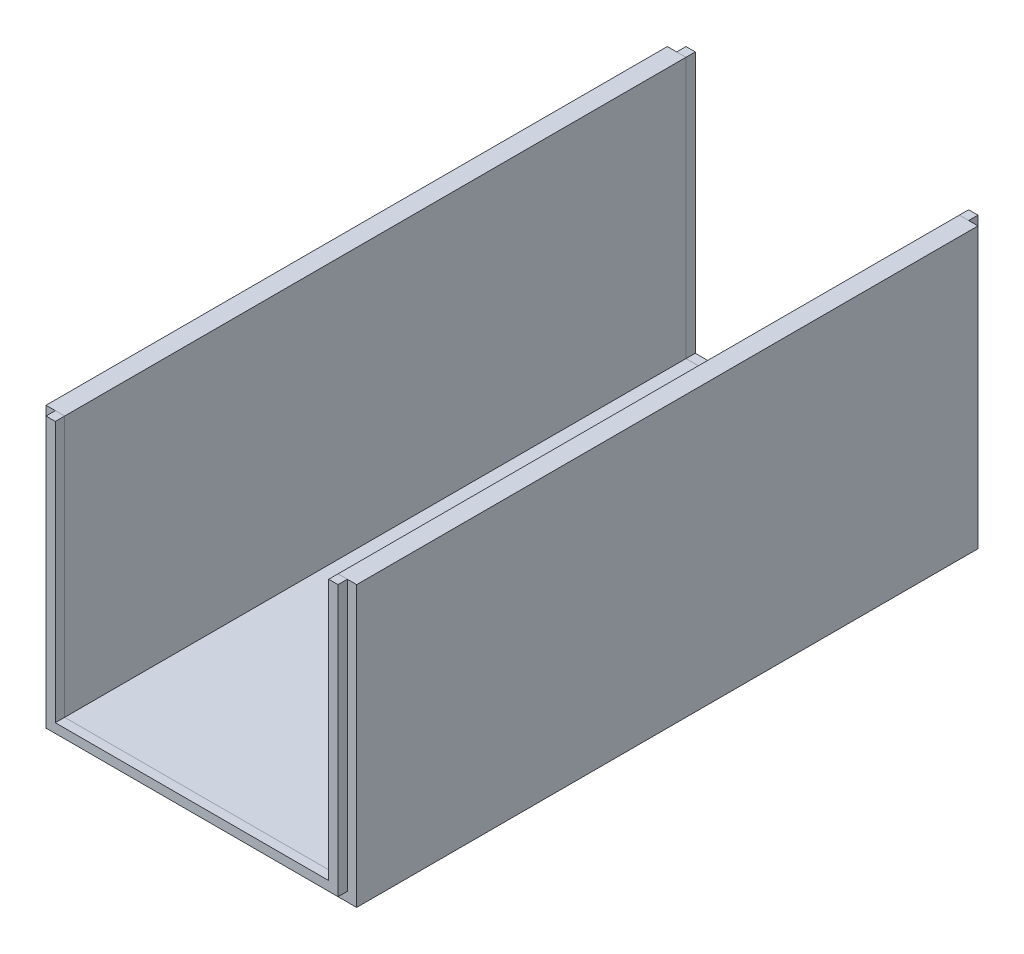
ISO-10303-21;
HEADER;
FILE_DESCRIPTION(('STEP AP214'),'2;1');
FILE_NAME('part.step','',(''),(''),'','','');
FILE_SCHEMA(('AUTOMOTIVE_DESIGN { 1 0 10303 214 1 1 1 1 }'));
ENDSEC;
DATA;
#1=APPLICATION_CONTEXT('core data for automotive mechanical design processes');
#2=APPLICATION_PROTOCOL_DEFINITION('international standard','automotive_design',2000,#1);
#3=PRODUCT_CONTEXT('',#1,'mechanical');
#4=PRODUCT('Part','Part','',(#3));
#5=PRODUCT_RELATED_PRODUCT_CATEGORY('part','',(#4));
#6=PRODUCT_DEFINITION_FORMATION('','',#4);
#7=PRODUCT_DEFINITION_CONTEXT('part definition',#1,'design');
#8=PRODUCT_DEFINITION('design','',#6,#7);
#9=PRODUCT_DEFINITION_SHAPE('','',#8);
#10=(LENGTH_UNIT() NAMED_UNIT(*) SI_UNIT(.MILLI.,.METRE.));
#11=(NAMED_UNIT(*) PLANE_ANGLE_UNIT() SI_UNIT($,.RADIAN.));
#12=(NAMED_UNIT(*) SI_UNIT($,.STERADIAN.) SOLID_ANGLE_UNIT());
#13=UNCERTAINTY_MEASURE_WITH_UNIT(LENGTH_MEASURE(1.E-05),#10,'distance_accuracy_value','');
#14=(GEOMETRIC_REPRESENTATION_CONTEXT(3) GLOBAL_UNCERTAINTY_ASSIGNED_CONTEXT((#13)) GLOBAL_UNIT_ASSIGNED_CONTEXT((#10,
#11,#12)) REPRESENTATION_CONTEXT('',''));
#15=CARTESIAN_POINT('',(0.,0.,0.));
#16=DIRECTION('',(0.,0.,1.));
#17=DIRECTION('',(1.,0.,0.));
#18=AXIS2_PLACEMENT_3D('',#15,#16,#17);
#19=CARTESIAN_POINT('',(-47.,87.,203.));
#20=DIRECTION('',(0.,1.,0.));
#21=DIRECTION('',(0.,0.,-1.));
#22=AXIS2_PLACEMENT_3D('',#19,#20,#21);
#23=PLANE('',#22);
#24=DIRECTION('',(1.,0.,0.));
#25=VECTOR('',#24,1.);
#26=CARTESIAN_POINT('',(-47.,87.,206.));
#27=LINE('',#26,#25);
#28=CARTESIAN_POINT('',(-47.,87.,206.));
#29=VERTEX_POINT('',#28);
#30=CARTESIAN_POINT('',(-44.,87.,206.));
#31=VERTEX_POINT('',#30);
#32=EDGE_CURVE('E143',#29,#31,#27,.T.);
#33=ORIENTED_EDGE('',*,*,#32,.T.);
#34=DIRECTION('',(0.,0.,1.));
#35=VECTOR('',#34,1.);
#36=CARTESIAN_POINT('',(-44.,87.,203.));
#37=LINE('',#36,#35);
#38=CARTESIAN_POINT('',(-44.,87.,203.));
#39=VERTEX_POINT('',#38);
#40=EDGE_CURVE('E50',#39,#31,#37,.T.);
#41=ORIENTED_EDGE('',*,*,#40,.F.);
#42=DIRECTION('',(1.,0.,0.));
#43=VECTOR('',#42,1.);
#44=CARTESIAN_POINT('',(-47.,87.,203.));
#45=LINE('',#44,#43);
#46=CARTESIAN_POINT('',(-47.,87.,203.));
#47=VERTEX_POINT('',#46);
#48=EDGE_CURVE('E156',#47,#39,#45,.T.);
#49=ORIENTED_EDGE('',*,*,#48,.F.);
#50=DIRECTION('',(0.,0.,1.));
#51=VECTOR('',#50,1.);
#52=CARTESIAN_POINT('',(-47.,87.,203.));
#53=LINE('',#52,#51);
#54=EDGE_CURVE('E12',#47,#29,#53,.T.);
#55=ORIENTED_EDGE('',*,*,#54,.T.);
#56=EDGE_LOOP('',(#33,#41,#49,#55));
#57=FACE_BOUND('',#56,.T.);
#58=ADVANCED_FACE('F47',(#57),#23,.T.);
#59=CARTESIAN_POINT('',(-47.,0.,203.));
#60=DIRECTION('',(-1.,0.,0.));
#61=DIRECTION('',(0.,0.,-1.));
#62=AXIS2_PLACEMENT_3D('',#59,#60,#61);
#63=PLANE('',#62);
#64=DIRECTION('',(0.,1.,0.));
#65=VECTOR('',#64,1.);
#66=CARTESIAN_POINT('',(-47.,0.,206.));
#67=LINE('',#66,#65);
#68=CARTESIAN_POINT('',(-47.,0.,206.));
#69=VERTEX_POINT('',#68);
#70=EDGE_CURVE('E100',#69,#29,#67,.T.);
#71=ORIENTED_EDGE('',*,*,#70,.T.);
#72=ORIENTED_EDGE('',*,*,#54,.F.);
#73=DIRECTION('',(0.,1.,0.));
#74=VECTOR('',#73,1.);
#75=CARTESIAN_POINT('',(-47.,0.,203.));
#76=LINE('',#75,#74);
#77=CARTESIAN_POINT('',(-47.,0.,203.));
#78=VERTEX_POINT('',#77);
#79=EDGE_CURVE('E65',#78,#47,#76,.T.);
#80=ORIENTED_EDGE('',*,*,#79,.F.);
#81=DIRECTION('',(0.,0.,1.));
#82=VECTOR('',#81,1.);
#83=CARTESIAN_POINT('',(-47.,0.,203.));
#84=LINE('',#83,#82);
#85=EDGE_CURVE('E56',#78,#69,#84,.T.);
#86=ORIENTED_EDGE('',*,*,#85,.T.);
#87=EDGE_LOOP('',(#71,#72,#80,#86));
#88=FACE_BOUND('',#87,.T.);
#89=ADVANCED_FACE('F202',(#88),#63,.T.);
#90=CARTESIAN_POINT('',(-47.,0.,203.));
#91=DIRECTION('',(0.,1.,0.));
#92=DIRECTION('',(-1.,0.,0.));
#93=AXIS2_PLACEMENT_3D('',#90,#91,#92);
#94=PLANE('',#93);
#95=DIRECTION('',(1.,0.,0.));
#96=VECTOR('',#95,1.);
#97=CARTESIAN_POINT('',(-47.,0.,206.));
#98=LINE('',#97,#96);
#99=CARTESIAN_POINT('',(47.,0.,206.));
#100=VERTEX_POINT('',#99);
#101=EDGE_CURVE('E94',#69,#100,#98,.T.);
#102=ORIENTED_EDGE('',*,*,#101,.F.);
#103=ORIENTED_EDGE('',*,*,#85,.F.);
#104=DIRECTION('',(1.,0.,0.));
#105=VECTOR('',#104,1.);
#106=CARTESIAN_POINT('',(-47.,0.,203.));
#107=LINE('',#106,#105);
#108=CARTESIAN_POINT('',(47.,0.,203.));
#109=VERTEX_POINT('',#108);
#110=EDGE_CURVE('E125',#78,#109,#107,.T.);
#111=ORIENTED_EDGE('',*,*,#110,.T.);
#112=DIRECTION('',(0.,0.,1.));
#113=VECTOR('',#112,1.);
#114=CARTESIAN_POINT('',(47.,0.,203.));
#115=LINE('',#114,#113);
#116=EDGE_CURVE('E132',#109,#100,#115,.T.);
#117=ORIENTED_EDGE('',*,*,#116,.T.);
#118=EDGE_LOOP('',(#102,#103,#111,#117));
#119=FACE_BOUND('',#118,.T.);
#120=ADVANCED_FACE('F138',(#119),#94,.F.);
#121=CARTESIAN_POINT('',(47.,0.,203.));
#122=DIRECTION('',(-1.,0.,0.));
#123=DIRECTION('',(0.,-1.,0.));
#124=AXIS2_PLACEMENT_3D('',#121,#122,#123);
#125=PLANE('',#124);
#126=DIRECTION('',(0.,1.,0.));
#127=VECTOR('',#126,1.);
#128=CARTESIAN_POINT('',(47.,0.,206.));
#129=LINE('',#128,#127);
#130=CARTESIAN_POINT('',(47.,87.,206.));
#131=VERTEX_POINT('',#130);
#132=EDGE_CURVE('E135',#100,#131,#129,.T.);
#133=ORIENTED_EDGE('',*,*,#132,.F.);
#134=ORIENTED_EDGE('',*,*,#116,.F.);
#135=DIRECTION('',(0.,1.,0.));
#136=VECTOR('',#135,1.);
#137=CARTESIAN_POINT('',(47.,0.,203.));
#138=LINE('',#137,#136);
#139=CARTESIAN_POINT('',(47.,87.,203.));
#140=VERTEX_POINT('',#139);
#141=EDGE_CURVE('E121',#109,#140,#138,.T.);
#142=ORIENTED_EDGE('',*,*,#141,.T.);
#143=DIRECTION('',(0.,0.,1.));
#144=VECTOR('',#143,1.);
#145=CARTESIAN_POINT('',(47.,87.,203.));
#146=LINE('',#145,#144);
#147=EDGE_CURVE('E136',#140,#131,#146,.T.);
#148=ORIENTED_EDGE('',*,*,#147,.T.);
#149=EDGE_LOOP('',(#133,#134,#142,#148));
#150=FACE_BOUND('',#149,.T.);
#151=ADVANCED_FACE('F133',(#150),#125,.F.);
#152=CARTESIAN_POINT('',(44.,87.,203.));
#153=DIRECTION('',(0.,1.,0.));
#154=DIRECTION('',(0.,0.,-1.));
#155=AXIS2_PLACEMENT_3D('',#152,#153,#154);
#156=PLANE('',#155);
#157=DIRECTION('',(1.,0.,0.));
#158=VECTOR('',#157,1.);
#159=CARTESIAN_POINT('',(44.,87.,206.));
#160=LINE('',#159,#158);
#161=CARTESIAN_POINT('',(44.,87.,206.));
#162=VERTEX_POINT('',#161);
#163=EDGE_CURVE('E152',#162,#131,#160,.T.);
#164=ORIENTED_EDGE('',*,*,#163,.T.);
#165=ORIENTED_EDGE('',*,*,#147,.F.);
#166=DIRECTION('',(1.,0.,0.));
#167=VECTOR('',#166,1.);
#168=CARTESIAN_POINT('',(44.,87.,203.));
#169=LINE('',#168,#167);
#170=CARTESIAN_POINT('',(44.,87.,203.));
#171=VERTEX_POINT('',#170);
#172=EDGE_CURVE('E127',#171,#140,#169,.T.);
#173=ORIENTED_EDGE('',*,*,#172,.F.);
#174=DIRECTION('',(0.,0.,1.));
#175=VECTOR('',#174,1.);
#176=CARTESIAN_POINT('',(44.,87.,203.));
#177=LINE('',#176,#175);
#178=EDGE_CURVE('E160',#171,#162,#177,.T.);
#179=ORIENTED_EDGE('',*,*,#178,.T.);
#180=EDGE_LOOP('',(#164,#165,#173,#179));
#181=FACE_BOUND('',#180,.T.);
#182=ADVANCED_FACE('F192',(#181),#156,.T.);
#183=CARTESIAN_POINT('',(44.,3.00000000000002,203.));
#184=DIRECTION('',(-1.,0.,0.));
#185=DIRECTION('',(0.,-1.,0.));
#186=AXIS2_PLACEMENT_3D('',#183,#184,#185);
#187=PLANE('',#186);
#188=DIRECTION('',(0.,1.,0.));
#189=VECTOR('',#188,1.);
#190=CARTESIAN_POINT('',(44.,3.00000000000002,206.));
#191=LINE('',#190,#189);
#192=CARTESIAN_POINT('',(44.,3.00000000000002,206.));
#193=VERTEX_POINT('',#192);
#194=EDGE_CURVE('E150',#193,#162,#191,.T.);
#195=ORIENTED_EDGE('',*,*,#194,.T.);
#196=ORIENTED_EDGE('',*,*,#178,.F.);
#197=DIRECTION('',(0.,1.,0.));
#198=VECTOR('',#197,1.);
#199=CARTESIAN_POINT('',(44.,3.00000000000002,203.));
#200=LINE('',#199,#198);
#201=CARTESIAN_POINT('',(44.,3.00000000000002,203.));
#202=VERTEX_POINT('',#201);
#203=EDGE_CURVE('E185',#202,#171,#200,.T.);
#204=ORIENTED_EDGE('',*,*,#203,.F.);
#205=DIRECTION('',(0.,0.,1.));
#206=VECTOR('',#205,1.);
#207=CARTESIAN_POINT('',(44.,3.00000000000002,203.));
#208=LINE('',#207,#206);
#209=EDGE_CURVE('E163',#202,#193,#208,.T.);
#210=ORIENTED_EDGE('',*,*,#209,.T.);
#211=EDGE_LOOP('',(#195,#196,#204,#210));
#212=FACE_BOUND('',#211,.T.);
#213=ADVANCED_FACE('F183',(#212),#187,.T.);
#214=CARTESIAN_POINT('',(-44.,3.,203.));
#215=DIRECTION('',(0.,1.,0.));
#216=DIRECTION('',(-1.,0.,0.));
#217=AXIS2_PLACEMENT_3D('',#214,#215,#216);
#218=PLANE('',#217);
#219=DIRECTION('',(1.,0.,0.));
#220=VECTOR('',#219,1.);
#221=CARTESIAN_POINT('',(-44.,3.,206.));
#222=LINE('',#221,#220);
#223=CARTESIAN_POINT('',(-44.,3.,206.));
#224=VERTEX_POINT('',#223);
#225=EDGE_CURVE('E148',#224,#193,#222,.T.);
#226=ORIENTED_EDGE('',*,*,#225,.T.);
#227=ORIENTED_EDGE('',*,*,#209,.F.);
#228=DIRECTION('',(1.,0.,0.));
#229=VECTOR('',#228,1.);
#230=CARTESIAN_POINT('',(-44.,3.,203.));
#231=LINE('',#230,#229);
#232=CARTESIAN_POINT('',(-44.,3.,203.));
#233=VERTEX_POINT('',#232);
#234=EDGE_CURVE('E186',#233,#202,#231,.T.);
#235=ORIENTED_EDGE('',*,*,#234,.F.);
#236=DIRECTION('',(0.,0.,1.));
#237=VECTOR('',#236,1.);
#238=CARTESIAN_POINT('',(-44.,3.,203.));
#239=LINE('',#238,#237);
#240=EDGE_CURVE('E165',#233,#224,#239,.T.);
#241=ORIENTED_EDGE('',*,*,#240,.T.);
#242=EDGE_LOOP('',(#226,#227,#235,#241));
#243=FACE_BOUND('',#242,.T.);
#244=ADVANCED_FACE('F180',(#243),#218,.T.);
#245=CARTESIAN_POINT('',(-44.,87.,203.));
#246=DIRECTION('',(1.,0.,0.));
#247=DIRECTION('',(0.,0.,1.));
#248=AXIS2_PLACEMENT_3D('',#245,#246,#247);
#249=PLANE('',#248);
#250=DIRECTION('',(0.,-1.,0.));
#251=VECTOR('',#250,1.);
#252=CARTESIAN_POINT('',(-44.,87.,206.));
#253=LINE('',#252,#251);
#254=EDGE_CURVE('E146',#31,#224,#253,.T.);
#255=ORIENTED_EDGE('',*,*,#254,.T.);
#256=ORIENTED_EDGE('',*,*,#240,.F.);
#257=DIRECTION('',(0.,-1.,0.));
#258=VECTOR('',#257,1.);
#259=CARTESIAN_POINT('',(-44.,87.,203.));
#260=LINE('',#259,#258);
#261=EDGE_CURVE('E108',#39,#233,#260,.T.);
#262=ORIENTED_EDGE('',*,*,#261,.F.);
#263=ORIENTED_EDGE('',*,*,#40,.T.);
#264=EDGE_LOOP('',(#255,#256,#262,#263));
#265=FACE_BOUND('',#264,.T.);
#266=ADVANCED_FACE('F171',(#265),#249,.T.);
#267=CARTESIAN_POINT('',(0.,0.,203.));
#268=DIRECTION('',(0.,0.,1.));
#269=DIRECTION('',(-1.,0.,0.));
#270=AXIS2_PLACEMENT_3D('',#267,#268,#269);
#271=PLANE('',#270);
#272=ORIENTED_EDGE('',*,*,#48,.T.);
#273=ORIENTED_EDGE('',*,*,#261,.T.);
#274=ORIENTED_EDGE('',*,*,#234,.T.);
#275=ORIENTED_EDGE('',*,*,#203,.T.);
#276=ORIENTED_EDGE('',*,*,#172,.T.);
#277=ORIENTED_EDGE('',*,*,#141,.F.);
#278=ORIENTED_EDGE('',*,*,#110,.F.);
#279=ORIENTED_EDGE('',*,*,#79,.T.);
#280=EDGE_LOOP('',(#272,#273,#274,#275,#276,#277,#278,#279));
#281=FACE_BOUND('',#280,.T.);
#282=ADVANCED_FACE('F123',(#281),#271,.F.);
#283=CARTESIAN_POINT('',(0.,0.,206.));
#284=DIRECTION('',(0.,0.,1.));
#285=DIRECTION('',(-1.,0.,0.));
#286=AXIS2_PLACEMENT_3D('',#283,#284,#285);
#287=PLANE('',#286);
#288=ORIENTED_EDGE('',*,*,#32,.F.);
#289=ORIENTED_EDGE('',*,*,#70,.F.);
#290=ORIENTED_EDGE('',*,*,#101,.T.);
#291=ORIENTED_EDGE('',*,*,#132,.T.);
#292=ORIENTED_EDGE('',*,*,#163,.F.);
#293=ORIENTED_EDGE('',*,*,#194,.F.);
#294=ORIENTED_EDGE('',*,*,#225,.F.);
#295=ORIENTED_EDGE('',*,*,#254,.F.);
#296=EDGE_LOOP('',(#288,#289,#290,#291,#292,#293,#294,#295));
#297=FACE_BOUND('',#296,.T.);
#298=ADVANCED_FACE('F176',(#297),#287,.T.);
#299=CLOSED_SHELL('',(#58,#89,#120,#151,#182,#213,#244,#266,#282,#298));
#300=MANIFOLD_SOLID_BREP('B2',#299);
#301=CARTESIAN_POINT('',(-50.,87.,103.));
#302=DIRECTION('',(0.,-1.,0.));
#303=DIRECTION('',(1.,0.,0.));
#304=AXIS2_PLACEMENT_3D('',#301,#302,#303);
#305=PLANE('',#304);
#306=DIRECTION('',(-1.,0.,0.));
#307=VECTOR('',#306,1.);
#308=CARTESIAN_POINT('',(-50.,87.,3.));
#309=LINE('',#308,#307);
#310=CARTESIAN_POINT('',(-44.,87.,3.));
#311=VERTEX_POINT('',#310);
#312=CARTESIAN_POINT('',(-50.,87.,3.));
#313=VERTEX_POINT('',#312);
#314=EDGE_CURVE('E431',#311,#313,#309,.T.);
#315=ORIENTED_EDGE('',*,*,#314,.T.);
#316=DIRECTION('',(0.,0.,-1.));
#317=VECTOR('',#316,1.);
#318=CARTESIAN_POINT('',(-50.,87.,103.));
#319=LINE('',#318,#317);
#320=CARTESIAN_POINT('',(-50.,87.,203.));
#321=VERTEX_POINT('',#320);
#322=EDGE_CURVE('E45',#321,#313,#319,.T.);
#323=ORIENTED_EDGE('',*,*,#322,.F.);
#324=DIRECTION('',(-1.,0.,0.));
#325=VECTOR('',#324,1.);
#326=CARTESIAN_POINT('',(-50.,87.,203.));
#327=LINE('',#326,#325);
#328=CARTESIAN_POINT('',(-44.,87.,203.));
#329=VERTEX_POINT('',#328);
#330=EDGE_CURVE('E404',#329,#321,#327,.T.);
#331=ORIENTED_EDGE('',*,*,#330,.F.);
#332=DIRECTION('',(0.,0.,-1.));
#333=VECTOR('',#332,1.);
#334=CARTESIAN_POINT('',(-44.,87.,103.));
#335=LINE('',#334,#333);
#336=EDGE_CURVE('E448',#329,#311,#335,.T.);
#337=ORIENTED_EDGE('',*,*,#336,.T.);
#338=EDGE_LOOP('',(#315,#323,#331,#337));
#339=FACE_BOUND('',#338,.T.);
#340=ADVANCED_FACE('F283',(#339),#305,.F.);
#341=CARTESIAN_POINT('',(-50.,-2.99999999999999,103.));
#342=DIRECTION('',(1.,0.,0.));
#343=DIRECTION('',(0.,0.,-1.));
#344=AXIS2_PLACEMENT_3D('',#341,#342,#343);
#345=PLANE('',#344);
#346=DIRECTION('',(0.,-1.,0.));
#347=VECTOR('',#346,1.);
#348=CARTESIAN_POINT('',(-50.,-2.99999999999999,3.));
#349=LINE('',#348,#347);
#350=CARTESIAN_POINT('',(-50.,-2.99999999999999,3.));
#351=VERTEX_POINT('',#350);
#352=EDGE_CURVE('E434',#313,#351,#349,.T.);
#353=ORIENTED_EDGE('',*,*,#352,.T.);
#354=DIRECTION('',(0.,0.,-1.));
#355=VECTOR('',#354,1.);
#356=CARTESIAN_POINT('',(-50.,-2.99999999999999,103.));
#357=LINE('',#356,#355);
#358=CARTESIAN_POINT('',(-50.,-2.99999999999999,203.));
#359=VERTEX_POINT('',#358);
#360=EDGE_CURVE('E290',#359,#351,#357,.T.);
#361=ORIENTED_EDGE('',*,*,#360,.F.);
#362=DIRECTION('',(0.,-1.,0.));
#363=VECTOR('',#362,1.);
#364=CARTESIAN_POINT('',(-50.,-2.99999999999999,203.));
#365=LINE('',#364,#363);
#366=EDGE_CURVE('E410',#321,#359,#365,.T.);
#367=ORIENTED_EDGE('',*,*,#366,.F.);
#368=ORIENTED_EDGE('',*,*,#322,.T.);
#369=EDGE_LOOP('',(#353,#361,#367,#368));
#370=FACE_BOUND('',#369,.T.);
#371=ADVANCED_FACE('F486',(#370),#345,.F.);
#372=CARTESIAN_POINT('',(50.,-2.99999999999998,103.));
#373=DIRECTION('',(0.,1.,0.));
#374=DIRECTION('',(-1.,0.,0.));
#375=AXIS2_PLACEMENT_3D('',#372,#373,#374);
#376=PLANE('',#375);
#377=DIRECTION('',(1.,0.,0.));
#378=VECTOR('',#377,1.);
#379=CARTESIAN_POINT('',(-6.25,-2.99999999999999,114.5));
#380=LINE('',#379,#378);
#381=CARTESIAN_POINT('',(-6.25,-2.99999999999999,114.5));
#382=VERTEX_POINT('',#381);
#383=CARTESIAN_POINT('',(6.25,-2.99999999999999,114.5));
#384=VERTEX_POINT('',#383);
#385=EDGE_CURVE('E379',#382,#384,#380,.T.);
#386=ORIENTED_EDGE('',*,*,#385,.T.);
#387=DIRECTION('',(0.,0.,-1.));
#388=VECTOR('',#387,1.);
#389=CARTESIAN_POINT('',(6.25,-2.99999999999999,114.5));
#390=LINE('',#389,#388);
#391=CARTESIAN_POINT('',(6.25,-2.99999999999999,91.5));
#392=VERTEX_POINT('',#391);
#393=EDGE_CURVE('E373',#384,#392,#390,.T.);
#394=ORIENTED_EDGE('',*,*,#393,.T.);
#395=DIRECTION('',(-1.,0.,0.));
#396=VECTOR('',#395,1.);
#397=CARTESIAN_POINT('',(-6.25,-2.99999999999999,91.5));
#398=LINE('',#397,#396);
#399=CARTESIAN_POINT('',(-6.25,-2.99999999999998,91.5));
#400=VERTEX_POINT('',#399);
#401=EDGE_CURVE('E382',#392,#400,#398,.T.);
#402=ORIENTED_EDGE('',*,*,#401,.T.);
#403=DIRECTION('',(0.,0.,1.));
#404=VECTOR('',#403,1.);
#405=CARTESIAN_POINT('',(-6.25,-2.99999999999999,114.5));
#406=LINE('',#405,#404);
#407=EDGE_CURVE('E297',#400,#382,#406,.T.);
#408=ORIENTED_EDGE('',*,*,#407,.T.);
#409=EDGE_LOOP('',(#386,#394,#402,#408));
#410=FACE_BOUND('',#409,.T.);
#411=DIRECTION('',(1.,0.,0.));
#412=VECTOR('',#411,1.);
#413=CARTESIAN_POINT('',(50.,-2.99999999999998,3.));
#414=LINE('',#413,#412);
#415=CARTESIAN_POINT('',(50.,-2.99999999999998,3.));
#416=VERTEX_POINT('',#415);
#417=EDGE_CURVE('E436',#351,#416,#414,.T.);
#418=ORIENTED_EDGE('',*,*,#417,.T.);
#419=DIRECTION('',(0.,0.,-1.));
#420=VECTOR('',#419,1.);
#421=CARTESIAN_POINT('',(50.,-2.99999999999998,103.));
#422=LINE('',#421,#420);
#423=CARTESIAN_POINT('',(50.,-2.99999999999998,203.));
#424=VERTEX_POINT('',#423);
#425=EDGE_CURVE('E463',#424,#416,#422,.T.);
#426=ORIENTED_EDGE('',*,*,#425,.F.);
#427=DIRECTION('',(1.,0.,0.));
#428=VECTOR('',#427,1.);
#429=CARTESIAN_POINT('',(50.,-2.99999999999998,203.));
#430=LINE('',#429,#428);
#431=EDGE_CURVE('E413',#359,#424,#430,.T.);
#432=ORIENTED_EDGE('',*,*,#431,.F.);
#433=ORIENTED_EDGE('',*,*,#360,.T.);
#434=EDGE_LOOP('',(#418,#426,#432,#433));
#435=FACE_BOUND('',#434,.T.);
#436=ADVANCED_FACE('F386',(#410,#435),#376,.F.);
#437=CARTESIAN_POINT('',(50.,87.,103.));
#438=DIRECTION('',(-1.,0.,0.));
#439=DIRECTION('',(0.,-1.,0.));
#440=AXIS2_PLACEMENT_3D('',#437,#438,#439);
#441=PLANE('',#440);
#442=DIRECTION('',(0.,1.,0.));
#443=VECTOR('',#442,1.);
#444=CARTESIAN_POINT('',(50.,87.,3.));
#445=LINE('',#444,#443);
#446=CARTESIAN_POINT('',(50.,87.,3.));
#447=VERTEX_POINT('',#446);
#448=EDGE_CURVE('E438',#416,#447,#445,.T.);
#449=ORIENTED_EDGE('',*,*,#448,.T.);
#450=DIRECTION('',(0.,0.,-1.));
#451=VECTOR('',#450,1.);
#452=CARTESIAN_POINT('',(50.,87.,103.));
#453=LINE('',#452,#451);
#454=CARTESIAN_POINT('',(50.,87.,203.));
#455=VERTEX_POINT('',#454);
#456=EDGE_CURVE('E460',#455,#447,#453,.T.);
#457=ORIENTED_EDGE('',*,*,#456,.F.);
#458=DIRECTION('',(0.,1.,0.));
#459=VECTOR('',#458,1.);
#460=CARTESIAN_POINT('',(50.,87.,203.));
#461=LINE('',#460,#459);
#462=EDGE_CURVE('E416',#424,#455,#461,.T.);
#463=ORIENTED_EDGE('',*,*,#462,.F.);
#464=ORIENTED_EDGE('',*,*,#425,.T.);
#465=EDGE_LOOP('',(#449,#457,#463,#464));
#466=FACE_BOUND('',#465,.T.);
#467=ADVANCED_FACE('F477',(#466),#441,.F.);
#468=CARTESIAN_POINT('',(44.,87.,103.));
#469=DIRECTION('',(0.,-1.,0.));
#470=DIRECTION('',(1.,0.,0.));
#471=AXIS2_PLACEMENT_3D('',#468,#469,#470);
#472=PLANE('',#471);
#473=DIRECTION('',(-1.,0.,0.));
#474=VECTOR('',#473,1.);
#475=CARTESIAN_POINT('',(44.,87.,3.));
#476=LINE('',#475,#474);
#477=CARTESIAN_POINT('',(44.,87.,3.));
#478=VERTEX_POINT('',#477);
#479=EDGE_CURVE('E440',#447,#478,#476,.T.);
#480=ORIENTED_EDGE('',*,*,#479,.T.);
#481=DIRECTION('',(0.,0.,-1.));
#482=VECTOR('',#481,1.);
#483=CARTESIAN_POINT('',(44.,87.,103.));
#484=LINE('',#483,#482);
#485=CARTESIAN_POINT('',(44.,87.,203.));
#486=VERTEX_POINT('',#485);
#487=EDGE_CURVE('E457',#486,#478,#484,.T.);
#488=ORIENTED_EDGE('',*,*,#487,.F.);
#489=DIRECTION('',(-1.,0.,0.));
#490=VECTOR('',#489,1.);
#491=CARTESIAN_POINT('',(44.,87.,203.));
#492=LINE('',#491,#490);
#493=EDGE_CURVE('E419',#455,#486,#492,.T.);
#494=ORIENTED_EDGE('',*,*,#493,.F.);
#495=ORIENTED_EDGE('',*,*,#456,.T.);
#496=EDGE_LOOP('',(#480,#488,#494,#495));
#497=FACE_BOUND('',#496,.T.);
#498=ADVANCED_FACE('F481',(#497),#472,.F.);
#499=CARTESIAN_POINT('',(44.,3.00000000000002,103.));
#500=DIRECTION('',(1.,0.,0.));
#501=DIRECTION('',(0.,1.,0.));
#502=AXIS2_PLACEMENT_3D('',#499,#500,#501);
#503=PLANE('',#502);
#504=DIRECTION('',(0.,-1.,0.));
#505=VECTOR('',#504,1.);
#506=CARTESIAN_POINT('',(44.,3.00000000000002,3.));
#507=LINE('',#506,#505);
#508=CARTESIAN_POINT('',(44.,3.00000000000002,3.));
#509=VERTEX_POINT('',#508);
#510=EDGE_CURVE('E442',#478,#509,#507,.T.);
#511=ORIENTED_EDGE('',*,*,#510,.T.);
#512=DIRECTION('',(0.,0.,-1.));
#513=VECTOR('',#512,1.);
#514=CARTESIAN_POINT('',(44.,3.00000000000002,103.));
#515=LINE('',#514,#513);
#516=CARTESIAN_POINT('',(44.,3.00000000000002,203.));
#517=VERTEX_POINT('',#516);
#518=EDGE_CURVE('E454',#517,#509,#515,.T.);
#519=ORIENTED_EDGE('',*,*,#518,.F.);
#520=DIRECTION('',(0.,-1.,0.));
#521=VECTOR('',#520,1.);
#522=CARTESIAN_POINT('',(44.,3.00000000000002,203.));
#523=LINE('',#522,#521);
#524=EDGE_CURVE('E422',#486,#517,#523,.T.);
#525=ORIENTED_EDGE('',*,*,#524,.F.);
#526=ORIENTED_EDGE('',*,*,#487,.T.);
#527=EDGE_LOOP('',(#511,#519,#525,#526));
#528=FACE_BOUND('',#527,.T.);
#529=ADVANCED_FACE('F497',(#528),#503,.F.);
#530=CARTESIAN_POINT('',(-44.,3.,103.));
#531=DIRECTION('',(0.,-1.,0.));
#532=DIRECTION('',(1.,0.,0.));
#533=AXIS2_PLACEMENT_3D('',#530,#531,#532);
#534=PLANE('',#533);
#535=DIRECTION('',(-1.,0.,0.));
#536=VECTOR('',#535,1.);
#537=CARTESIAN_POINT('',(-6.25,3.00000000000001,91.5));
#538=LINE('',#537,#536);
#539=CARTESIAN_POINT('',(6.25000000000001,3.00000000000001,91.5));
#540=VERTEX_POINT('',#539);
#541=CARTESIAN_POINT('',(-6.25,3.00000000000001,91.5));
#542=VERTEX_POINT('',#541);
#543=EDGE_CURVE('E398',#540,#542,#538,.T.);
#544=ORIENTED_EDGE('',*,*,#543,.F.);
#545=DIRECTION('',(0.,0.,-1.));
#546=VECTOR('',#545,1.);
#547=CARTESIAN_POINT('',(6.25,3.00000000000001,114.5));
#548=LINE('',#547,#546);
#549=CARTESIAN_POINT('',(6.25,3.00000000000001,114.5));
#550=VERTEX_POINT('',#549);
#551=EDGE_CURVE('E305',#550,#540,#548,.T.);
#552=ORIENTED_EDGE('',*,*,#551,.F.);
#553=DIRECTION('',(1.,0.,0.));
#554=VECTOR('',#553,1.);
#555=CARTESIAN_POINT('',(-6.25,3.00000000000001,114.5));
#556=LINE('',#555,#554);
#557=CARTESIAN_POINT('',(-6.25,3.00000000000001,114.5));
#558=VERTEX_POINT('',#557);
#559=EDGE_CURVE('E389',#558,#550,#556,.T.);
#560=ORIENTED_EDGE('',*,*,#559,.F.);
#561=DIRECTION('',(0.,0.,1.));
#562=VECTOR('',#561,1.);
#563=CARTESIAN_POINT('',(-6.25,3.00000000000001,114.5));
#564=LINE('',#563,#562);
#565=EDGE_CURVE('E392',#542,#558,#564,.T.);
#566=ORIENTED_EDGE('',*,*,#565,.F.);
#567=EDGE_LOOP('',(#544,#552,#560,#566));
#568=FACE_BOUND('',#567,.T.);
#569=DIRECTION('',(-1.,0.,0.));
#570=VECTOR('',#569,1.);
#571=CARTESIAN_POINT('',(-44.,3.,3.));
#572=LINE('',#571,#570);
#573=CARTESIAN_POINT('',(-44.,3.,3.));
#574=VERTEX_POINT('',#573);
#575=EDGE_CURVE('E444',#509,#574,#572,.T.);
#576=ORIENTED_EDGE('',*,*,#575,.T.);
#577=DIRECTION('',(0.,0.,-1.));
#578=VECTOR('',#577,1.);
#579=CARTESIAN_POINT('',(-44.,3.,103.));
#580=LINE('',#579,#578);
#581=CARTESIAN_POINT('',(-44.,3.,203.));
#582=VERTEX_POINT('',#581);
#583=EDGE_CURVE('E451',#582,#574,#580,.T.);
#584=ORIENTED_EDGE('',*,*,#583,.F.);
#585=DIRECTION('',(-1.,0.,0.));
#586=VECTOR('',#585,1.);
#587=CARTESIAN_POINT('',(-44.,3.,203.));
#588=LINE('',#587,#586);
#589=EDGE_CURVE('E425',#517,#582,#588,.T.);
#590=ORIENTED_EDGE('',*,*,#589,.F.);
#591=ORIENTED_EDGE('',*,*,#518,.T.);
#592=EDGE_LOOP('',(#576,#584,#590,#591));
#593=FACE_BOUND('',#592,.T.);
#594=ADVANCED_FACE('F495',(#568,#593),#534,.F.);
#595=CARTESIAN_POINT('',(-44.,87.,103.));
#596=DIRECTION('',(-1.,0.,0.));
#597=DIRECTION('',(0.,0.,1.));
#598=AXIS2_PLACEMENT_3D('',#595,#596,#597);
#599=PLANE('',#598);
#600=DIRECTION('',(0.,1.,0.));
#601=VECTOR('',#600,1.);
#602=CARTESIAN_POINT('',(-44.,87.,3.));
#603=LINE('',#602,#601);
#604=EDGE_CURVE('E446',#574,#311,#603,.T.);
#605=ORIENTED_EDGE('',*,*,#604,.T.);
#606=ORIENTED_EDGE('',*,*,#336,.F.);
#607=DIRECTION('',(0.,1.,0.));
#608=VECTOR('',#607,1.);
#609=CARTESIAN_POINT('',(-44.,87.,203.));
#610=LINE('',#609,#608);
#611=EDGE_CURVE('E428',#582,#329,#610,.T.);
#612=ORIENTED_EDGE('',*,*,#611,.F.);
#613=ORIENTED_EDGE('',*,*,#583,.T.);
#614=EDGE_LOOP('',(#605,#606,#612,#613));
#615=FACE_BOUND('',#614,.T.);
#616=ADVANCED_FACE('F491',(#615),#599,.F.);
#617=CARTESIAN_POINT('',(0.,0.,3.));
#618=DIRECTION('',(0.,0.,-1.));
#619=DIRECTION('',(-1.,0.,0.));
#620=AXIS2_PLACEMENT_3D('',#617,#618,#619);
#621=PLANE('',#620);
#622=ORIENTED_EDGE('',*,*,#314,.F.);
#623=ORIENTED_EDGE('',*,*,#604,.F.);
#624=ORIENTED_EDGE('',*,*,#575,.F.);
#625=ORIENTED_EDGE('',*,*,#510,.F.);
#626=ORIENTED_EDGE('',*,*,#479,.F.);
#627=ORIENTED_EDGE('',*,*,#448,.F.);
#628=ORIENTED_EDGE('',*,*,#417,.F.);
#629=ORIENTED_EDGE('',*,*,#352,.F.);
#630=EDGE_LOOP('',(#622,#623,#624,#625,#626,#627,#628,#629));
#631=FACE_BOUND('',#630,.T.);
#632=ADVANCED_FACE('F473',(#631),#621,.T.);
#633=CARTESIAN_POINT('',(0.,0.,203.));
#634=DIRECTION('',(0.,0.,1.));
#635=DIRECTION('',(-1.,0.,0.));
#636=AXIS2_PLACEMENT_3D('',#633,#634,#635);
#637=PLANE('',#636);
#638=ORIENTED_EDGE('',*,*,#330,.T.);
#639=ORIENTED_EDGE('',*,*,#366,.T.);
#640=ORIENTED_EDGE('',*,*,#431,.T.);
#641=ORIENTED_EDGE('',*,*,#462,.T.);
#642=ORIENTED_EDGE('',*,*,#493,.T.);
#643=ORIENTED_EDGE('',*,*,#524,.T.);
#644=ORIENTED_EDGE('',*,*,#589,.T.);
#645=ORIENTED_EDGE('',*,*,#611,.T.);
#646=EDGE_LOOP('',(#638,#639,#640,#641,#642,#643,#644,#645));
#647=FACE_BOUND('',#646,.T.);
#648=ADVANCED_FACE('F484',(#647),#637,.T.);
#649=CARTESIAN_POINT('',(6.25,-2.99999999999999,114.5));
#650=DIRECTION('',(1.,0.,0.));
#651=DIRECTION('',(0.,1.,0.));
#652=AXIS2_PLACEMENT_3D('',#649,#650,#651);
#653=PLANE('',#652);
#654=ORIENTED_EDGE('',*,*,#551,.T.);
#655=DIRECTION('',(0.,1.,0.));
#656=VECTOR('',#655,1.);
#657=CARTESIAN_POINT('',(6.25,-2.99999999999999,91.5));
#658=LINE('',#657,#656);
#659=EDGE_CURVE('E369',#392,#540,#658,.T.);
#660=ORIENTED_EDGE('',*,*,#659,.F.);
#661=ORIENTED_EDGE('',*,*,#393,.F.);
#662=DIRECTION('',(0.,1.,0.));
#663=VECTOR('',#662,1.);
#664=CARTESIAN_POINT('',(6.25,-2.99999999999999,114.5));
#665=LINE('',#664,#663);
#666=EDGE_CURVE('E402',#384,#550,#665,.T.);
#667=ORIENTED_EDGE('',*,*,#666,.T.);
#668=EDGE_LOOP('',(#654,#660,#661,#667));
#669=FACE_BOUND('',#668,.T.);
#670=ADVANCED_FACE('F371',(#669),#653,.F.);
#671=CARTESIAN_POINT('',(-6.25,-2.99999999999999,114.5));
#672=DIRECTION('',(0.,0.,1.));
#673=DIRECTION('',(1.,0.,0.));
#674=AXIS2_PLACEMENT_3D('',#671,#672,#673);
#675=PLANE('',#674);
#676=ORIENTED_EDGE('',*,*,#559,.T.);
#677=ORIENTED_EDGE('',*,*,#666,.F.);
#678=ORIENTED_EDGE('',*,*,#385,.F.);
#679=DIRECTION('',(0.,1.,0.));
#680=VECTOR('',#679,1.);
#681=CARTESIAN_POINT('',(-6.25,-2.99999999999999,114.5));
#682=LINE('',#681,#680);
#683=EDGE_CURVE('E405',#382,#558,#682,.T.);
#684=ORIENTED_EDGE('',*,*,#683,.T.);
#685=EDGE_LOOP('',(#676,#677,#678,#684));
#686=FACE_BOUND('',#685,.T.);
#687=ADVANCED_FACE('F571',(#686),#675,.F.);
#688=CARTESIAN_POINT('',(-6.25,-2.99999999999999,114.5));
#689=DIRECTION('',(-1.,0.,0.));
#690=DIRECTION('',(0.,-1.,0.));
#691=AXIS2_PLACEMENT_3D('',#688,#689,#690);
#692=PLANE('',#691);
#693=ORIENTED_EDGE('',*,*,#565,.T.);
#694=ORIENTED_EDGE('',*,*,#683,.F.);
#695=ORIENTED_EDGE('',*,*,#407,.F.);
#696=DIRECTION('',(0.,1.,0.));
#697=VECTOR('',#696,1.);
#698=CARTESIAN_POINT('',(-6.25,-2.99999999999999,91.5));
#699=LINE('',#698,#697);
#700=EDGE_CURVE('E378',#400,#542,#699,.T.);
#701=ORIENTED_EDGE('',*,*,#700,.T.);
#702=EDGE_LOOP('',(#693,#694,#695,#701));
#703=FACE_BOUND('',#702,.T.);
#704=ADVANCED_FACE('F580',(#703),#692,.F.);
#705=CARTESIAN_POINT('',(-6.25,-2.99999999999999,91.5));
#706=DIRECTION('',(0.,0.,-1.));
#707=DIRECTION('',(-1.,0.,0.));
#708=AXIS2_PLACEMENT_3D('',#705,#706,#707);
#709=PLANE('',#708);
#710=ORIENTED_EDGE('',*,*,#543,.T.);
#711=ORIENTED_EDGE('',*,*,#700,.F.);
#712=ORIENTED_EDGE('',*,*,#401,.F.);
#713=ORIENTED_EDGE('',*,*,#659,.T.);
#714=EDGE_LOOP('',(#710,#711,#712,#713));
#715=FACE_BOUND('',#714,.T.);
#716=ADVANCED_FACE('F383',(#715),#709,.F.);
#717=CLOSED_SHELL('',(#340,#371,#436,#467,#498,#529,#594,#616,#632,#648,#670,#687,#704,#716));
#718=MANIFOLD_SOLID_BREP('B6',#717);
#719=CARTESIAN_POINT('',(-47.,87.,3.));
#720=DIRECTION('',(0.,1.,0.));
#721=DIRECTION('',(0.,0.,1.));
#722=AXIS2_PLACEMENT_3D('',#719,#720,#721);
#723=PLANE('',#722);
#724=DIRECTION('',(1.,0.,0.));
#725=VECTOR('',#724,1.);
#726=CARTESIAN_POINT('',(-47.,87.,0.));
#727=LINE('',#726,#725);
#728=CARTESIAN_POINT('',(-47.,87.,0.));
#729=VERTEX_POINT('',#728);
#730=CARTESIAN_POINT('',(-44.,87.,0.));
#731=VERTEX_POINT('',#730);
#732=EDGE_CURVE('E737',#729,#731,#727,.T.);
#733=ORIENTED_EDGE('',*,*,#732,.F.);
#734=DIRECTION('',(0.,0.,-1.));
#735=VECTOR('',#734,1.);
#736=CARTESIAN_POINT('',(-47.,87.,3.));
#737=LINE('',#736,#735);
#738=CARTESIAN_POINT('',(-47.,87.,3.));
#739=VERTEX_POINT('',#738);
#740=EDGE_CURVE('E281',#739,#729,#737,.T.);
#741=ORIENTED_EDGE('',*,*,#740,.F.);
#742=DIRECTION('',(1.,0.,0.));
#743=VECTOR('',#742,1.);
#744=CARTESIAN_POINT('',(-47.,87.,3.));
#745=LINE('',#744,#743);
#746=CARTESIAN_POINT('',(-44.,87.,3.));
#747=VERTEX_POINT('',#746);
#748=EDGE_CURVE('E757',#739,#747,#745,.T.);
#749=ORIENTED_EDGE('',*,*,#748,.T.);
#750=DIRECTION('',(0.,0.,-1.));
#751=VECTOR('',#750,1.);
#752=CARTESIAN_POINT('',(-44.,87.,3.));
#753=LINE('',#752,#751);
#754=EDGE_CURVE('E643',#747,#731,#753,.T.);
#755=ORIENTED_EDGE('',*,*,#754,.T.);
#756=EDGE_LOOP('',(#733,#741,#749,#755));
#757=FACE_BOUND('',#756,.T.);
#758=ADVANCED_FACE('F640',(#757),#723,.T.);
#759=CARTESIAN_POINT('',(-47.,0.,3.));
#760=DIRECTION('',(-1.,0.,0.));
#761=DIRECTION('',(0.,0.,1.));
#762=AXIS2_PLACEMENT_3D('',#759,#760,#761);
#763=PLANE('',#762);
#764=DIRECTION('',(0.,1.,0.));
#765=VECTOR('',#764,1.);
#766=CARTESIAN_POINT('',(-47.,0.,0.));
#767=LINE('',#766,#765);
#768=CARTESIAN_POINT('',(-47.,0.,0.));
#769=VERTEX_POINT('',#768);
#770=EDGE_CURVE('E755',#769,#729,#767,.T.);
#771=ORIENTED_EDGE('',*,*,#770,.F.);
#772=DIRECTION('',(0.,0.,-1.));
#773=VECTOR('',#772,1.);
#774=CARTESIAN_POINT('',(-47.,0.,3.));
#775=LINE('',#774,#773);
#776=CARTESIAN_POINT('',(-47.,0.,3.));
#777=VERTEX_POINT('',#776);
#778=EDGE_CURVE('E649',#777,#769,#775,.T.);
#779=ORIENTED_EDGE('',*,*,#778,.F.);
#780=DIRECTION('',(0.,1.,0.));
#781=VECTOR('',#780,1.);
#782=CARTESIAN_POINT('',(-47.,0.,3.));
#783=LINE('',#782,#781);
#784=EDGE_CURVE('E717',#777,#739,#783,.T.);
#785=ORIENTED_EDGE('',*,*,#784,.T.);
#786=ORIENTED_EDGE('',*,*,#740,.T.);
#787=EDGE_LOOP('',(#771,#779,#785,#786));
#788=FACE_BOUND('',#787,.T.);
#789=ADVANCED_FACE('F769',(#788),#763,.T.);
#790=CARTESIAN_POINT('',(-47.,0.,3.));
#791=DIRECTION('',(0.,1.,0.));
#792=DIRECTION('',(-1.,0.,0.));
#793=AXIS2_PLACEMENT_3D('',#790,#791,#792);
#794=PLANE('',#793);
#795=DIRECTION('',(1.,0.,0.));
#796=VECTOR('',#795,1.);
#797=CARTESIAN_POINT('',(-47.,0.,0.));
#798=LINE('',#797,#796);
#799=CARTESIAN_POINT('',(47.,0.,0.));
#800=VERTEX_POINT('',#799);
#801=EDGE_CURVE('E722',#769,#800,#798,.T.);
#802=ORIENTED_EDGE('',*,*,#801,.T.);
#803=DIRECTION('',(0.,0.,-1.));
#804=VECTOR('',#803,1.);
#805=CARTESIAN_POINT('',(47.,0.,3.));
#806=LINE('',#805,#804);
#807=CARTESIAN_POINT('',(47.,0.,3.));
#808=VERTEX_POINT('',#807);
#809=EDGE_CURVE('E720',#808,#800,#806,.T.);
#810=ORIENTED_EDGE('',*,*,#809,.F.);
#811=DIRECTION('',(1.,0.,0.));
#812=VECTOR('',#811,1.);
#813=CARTESIAN_POINT('',(-47.,0.,3.));
#814=LINE('',#813,#812);
#815=EDGE_CURVE('E710',#777,#808,#814,.T.);
#816=ORIENTED_EDGE('',*,*,#815,.F.);
#817=ORIENTED_EDGE('',*,*,#778,.T.);
#818=EDGE_LOOP('',(#802,#810,#816,#817));
#819=FACE_BOUND('',#818,.T.);
#820=ADVANCED_FACE('F721',(#819),#794,.F.);
#821=CARTESIAN_POINT('',(47.,0.,3.));
#822=DIRECTION('',(-1.,0.,0.));
#823=DIRECTION('',(0.,-1.,0.));
#824=AXIS2_PLACEMENT_3D('',#821,#822,#823);
#825=PLANE('',#824);
#826=DIRECTION('',(0.,1.,0.));
#827=VECTOR('',#826,1.);
#828=CARTESIAN_POINT('',(47.,0.,0.));
#829=LINE('',#828,#827);
#830=CARTESIAN_POINT('',(47.,87.,0.));
#831=VERTEX_POINT('',#830);
#832=EDGE_CURVE('E752',#800,#831,#829,.T.);
#833=ORIENTED_EDGE('',*,*,#832,.T.);
#834=DIRECTION('',(0.,0.,-1.));
#835=VECTOR('',#834,1.);
#836=CARTESIAN_POINT('',(47.,87.,3.));
#837=LINE('',#836,#835);
#838=CARTESIAN_POINT('',(47.,87.,3.));
#839=VERTEX_POINT('',#838);
#840=EDGE_CURVE('E726',#839,#831,#837,.T.);
#841=ORIENTED_EDGE('',*,*,#840,.F.);
#842=DIRECTION('',(0.,1.,0.));
#843=VECTOR('',#842,1.);
#844=CARTESIAN_POINT('',(47.,0.,3.));
#845=LINE('',#844,#843);
#846=EDGE_CURVE('E715',#808,#839,#845,.T.);
#847=ORIENTED_EDGE('',*,*,#846,.F.);
#848=ORIENTED_EDGE('',*,*,#809,.T.);
#849=EDGE_LOOP('',(#833,#841,#847,#848));
#850=FACE_BOUND('',#849,.T.);
#851=ADVANCED_FACE('F728',(#850),#825,.F.);
#852=CARTESIAN_POINT('',(44.,87.,3.));
#853=DIRECTION('',(0.,1.,0.));
#854=DIRECTION('',(0.,0.,1.));
#855=AXIS2_PLACEMENT_3D('',#852,#853,#854);
#856=PLANE('',#855);
#857=DIRECTION('',(1.,0.,0.));
#858=VECTOR('',#857,1.);
#859=CARTESIAN_POINT('',(44.,87.,0.));
#860=LINE('',#859,#858);
#861=CARTESIAN_POINT('',(44.,87.,0.));
#862=VERTEX_POINT('',#861);
#863=EDGE_CURVE('E749',#862,#831,#860,.T.);
#864=ORIENTED_EDGE('',*,*,#863,.F.);
#865=DIRECTION('',(0.,0.,-1.));
#866=VECTOR('',#865,1.);
#867=CARTESIAN_POINT('',(44.,87.,3.));
#868=LINE('',#867,#866);
#869=CARTESIAN_POINT('',(44.,87.,3.));
#870=VERTEX_POINT('',#869);
#871=EDGE_CURVE('E761',#870,#862,#868,.T.);
#872=ORIENTED_EDGE('',*,*,#871,.F.);
#873=DIRECTION('',(1.,0.,0.));
#874=VECTOR('',#873,1.);
#875=CARTESIAN_POINT('',(44.,87.,3.));
#876=LINE('',#875,#874);
#877=EDGE_CURVE('E730',#870,#839,#876,.T.);
#878=ORIENTED_EDGE('',*,*,#877,.T.);
#879=ORIENTED_EDGE('',*,*,#840,.T.);
#880=EDGE_LOOP('',(#864,#872,#878,#879));
#881=FACE_BOUND('',#880,.T.);
#882=ADVANCED_FACE('F782',(#881),#856,.T.);
#883=CARTESIAN_POINT('',(44.,3.00000000000002,3.));
#884=DIRECTION('',(-1.,0.,0.));
#885=DIRECTION('',(0.,-1.,0.));
#886=AXIS2_PLACEMENT_3D('',#883,#884,#885);
#887=PLANE('',#886);
#888=DIRECTION('',(0.,1.,0.));
#889=VECTOR('',#888,1.);
#890=CARTESIAN_POINT('',(44.,3.00000000000002,0.));
#891=LINE('',#890,#889);
#892=CARTESIAN_POINT('',(44.,3.00000000000002,0.));
#893=VERTEX_POINT('',#892);
#894=EDGE_CURVE('E746',#893,#862,#891,.T.);
#895=ORIENTED_EDGE('',*,*,#894,.F.);
#896=DIRECTION('',(0.,0.,-1.));
#897=VECTOR('',#896,1.);
#898=CARTESIAN_POINT('',(44.,3.00000000000002,3.));
#899=LINE('',#898,#897);
#900=CARTESIAN_POINT('',(44.,3.00000000000002,3.));
#901=VERTEX_POINT('',#900);
#902=EDGE_CURVE('E763',#901,#893,#899,.T.);
#903=ORIENTED_EDGE('',*,*,#902,.F.);
#904=DIRECTION('',(0.,1.,0.));
#905=VECTOR('',#904,1.);
#906=CARTESIAN_POINT('',(44.,3.00000000000002,3.));
#907=LINE('',#906,#905);
#908=EDGE_CURVE('E732',#901,#870,#907,.T.);
#909=ORIENTED_EDGE('',*,*,#908,.T.);
#910=ORIENTED_EDGE('',*,*,#871,.T.);
#911=EDGE_LOOP('',(#895,#903,#909,#910));
#912=FACE_BOUND('',#911,.T.);
#913=ADVANCED_FACE('F785',(#912),#887,.T.);
#914=CARTESIAN_POINT('',(-44.,3.,3.));
#915=DIRECTION('',(0.,1.,0.));
#916=DIRECTION('',(-1.,0.,0.));
#917=AXIS2_PLACEMENT_3D('',#914,#915,#916);
#918=PLANE('',#917);
#919=DIRECTION('',(1.,0.,0.));
#920=VECTOR('',#919,1.);
#921=CARTESIAN_POINT('',(-44.,3.,0.));
#922=LINE('',#921,#920);
#923=CARTESIAN_POINT('',(-44.,3.,0.));
#924=VERTEX_POINT('',#923);
#925=EDGE_CURVE('E743',#924,#893,#922,.T.);
#926=ORIENTED_EDGE('',*,*,#925,.F.);
#927=DIRECTION('',(0.,0.,-1.));
#928=VECTOR('',#927,1.);
#929=CARTESIAN_POINT('',(-44.,3.,3.));
#930=LINE('',#929,#928);
#931=CARTESIAN_POINT('',(-44.,3.,3.));
#932=VERTEX_POINT('',#931);
#933=EDGE_CURVE('E764',#932,#924,#930,.T.);
#934=ORIENTED_EDGE('',*,*,#933,.F.);
#935=DIRECTION('',(1.,0.,0.));
#936=VECTOR('',#935,1.);
#937=CARTESIAN_POINT('',(-44.,3.,3.));
#938=LINE('',#937,#936);
#939=EDGE_CURVE('E860',#932,#901,#938,.T.);
#940=ORIENTED_EDGE('',*,*,#939,.T.);
#941=ORIENTED_EDGE('',*,*,#902,.T.);
#942=EDGE_LOOP('',(#926,#934,#940,#941));
#943=FACE_BOUND('',#942,.T.);
#944=ADVANCED_FACE('F789',(#943),#918,.T.);
#945=CARTESIAN_POINT('',(-44.,87.,3.));
#946=DIRECTION('',(1.,0.,0.));
#947=DIRECTION('',(0.,0.,-1.));
#948=AXIS2_PLACEMENT_3D('',#945,#946,#947);
#949=PLANE('',#948);
#950=DIRECTION('',(0.,-1.,0.));
#951=VECTOR('',#950,1.);
#952=CARTESIAN_POINT('',(-44.,87.,0.));
#953=LINE('',#952,#951);
#954=EDGE_CURVE('E740',#731,#924,#953,.T.);
#955=ORIENTED_EDGE('',*,*,#954,.F.);
#956=ORIENTED_EDGE('',*,*,#754,.F.);
#957=DIRECTION('',(0.,-1.,0.));
#958=VECTOR('',#957,1.);
#959=CARTESIAN_POINT('',(-44.,87.,3.));
#960=LINE('',#959,#958);
#961=EDGE_CURVE('E861',#747,#932,#960,.T.);
#962=ORIENTED_EDGE('',*,*,#961,.T.);
#963=ORIENTED_EDGE('',*,*,#933,.T.);
#964=EDGE_LOOP('',(#955,#956,#962,#963));
#965=FACE_BOUND('',#964,.T.);
#966=ADVANCED_FACE('F766',(#965),#949,.T.);
#967=CARTESIAN_POINT('',(0.,0.,3.));
#968=DIRECTION('',(0.,0.,-1.));
#969=DIRECTION('',(-1.,0.,0.));
#970=AXIS2_PLACEMENT_3D('',#967,#968,#969);
#971=PLANE('',#970);
#972=ORIENTED_EDGE('',*,*,#748,.F.);
#973=ORIENTED_EDGE('',*,*,#784,.F.);
#974=ORIENTED_EDGE('',*,*,#815,.T.);
#975=ORIENTED_EDGE('',*,*,#846,.T.);
#976=ORIENTED_EDGE('',*,*,#877,.F.);
#977=ORIENTED_EDGE('',*,*,#908,.F.);
#978=ORIENTED_EDGE('',*,*,#939,.F.);
#979=ORIENTED_EDGE('',*,*,#961,.F.);
#980=EDGE_LOOP('',(#972,#973,#974,#975,#976,#977,#978,#979));
#981=FACE_BOUND('',#980,.T.);
#982=ADVANCED_FACE('F712',(#981),#971,.F.);
#983=CARTESIAN_POINT('',(0.,0.,0.));
#984=DIRECTION('',(0.,0.,-1.));
#985=DIRECTION('',(-1.,0.,0.));
#986=AXIS2_PLACEMENT_3D('',#983,#984,#985);
#987=PLANE('',#986);
#988=ORIENTED_EDGE('',*,*,#732,.T.);
#989=ORIENTED_EDGE('',*,*,#954,.T.);
#990=ORIENTED_EDGE('',*,*,#925,.T.);
#991=ORIENTED_EDGE('',*,*,#894,.T.);
#992=ORIENTED_EDGE('',*,*,#863,.T.);
#993=ORIENTED_EDGE('',*,*,#832,.F.);
#994=ORIENTED_EDGE('',*,*,#801,.F.);
#995=ORIENTED_EDGE('',*,*,#770,.T.);
#996=EDGE_LOOP('',(#988,#989,#990,#991,#992,#993,#994,#995));
#997=FACE_BOUND('',#996,.T.);
#998=ADVANCED_FACE('F768',(#997),#987,.T.);
#999=CLOSED_SHELL('',(#758,#789,#820,#851,#882,#913,#944,#966,#982,#998));
#1000=MANIFOLD_SOLID_BREP('B39',#999);
#1001=ADVANCED_BREP_SHAPE_REPRESENTATION('',(#18,#300,#718,#1000),#14);
#1002=SHAPE_DEFINITION_REPRESENTATION(#9,#1001);
ENDSEC;
END-ISO-10303-21;
